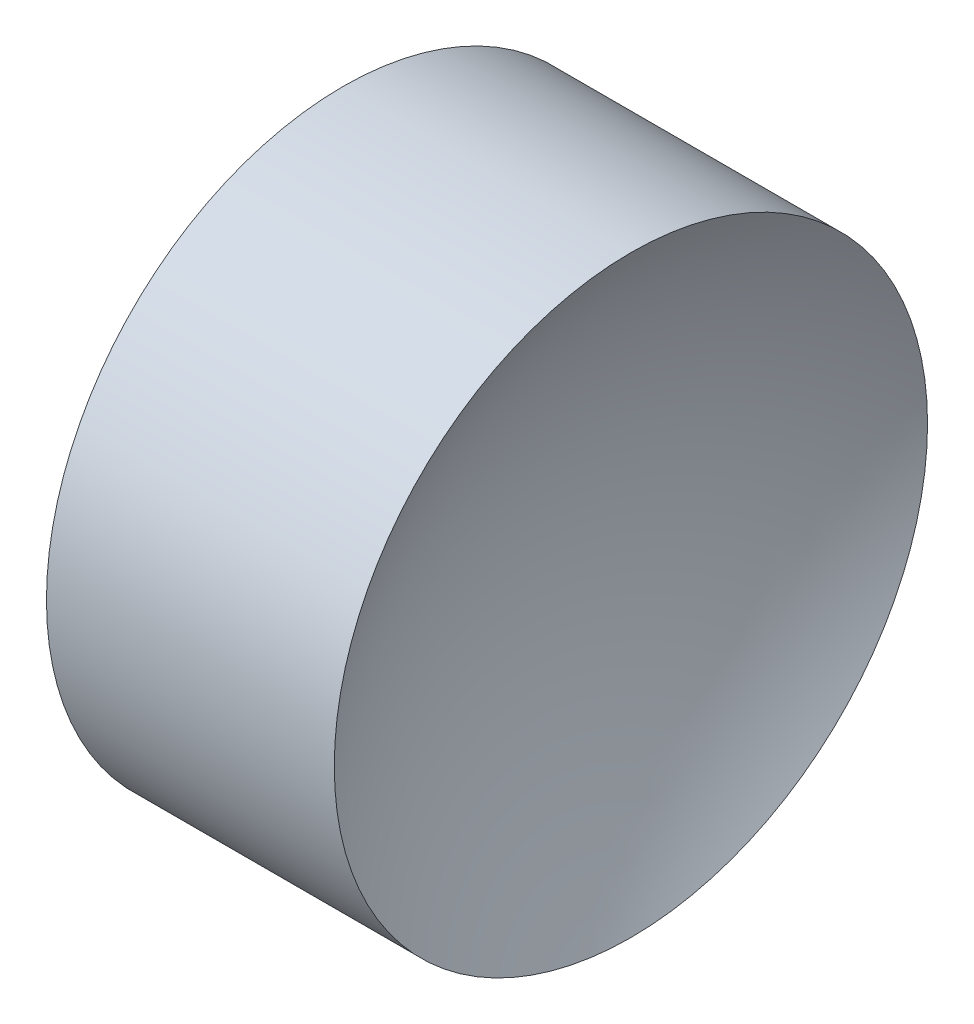
ISO-10303-21;
HEADER;
FILE_DESCRIPTION(('STEP AP214'),'2;1');
FILE_NAME('part.step','',(''),(''),'','','');
FILE_SCHEMA(('AUTOMOTIVE_DESIGN { 1 0 10303 214 1 1 1 1 }'));
ENDSEC;
DATA;
#1=APPLICATION_CONTEXT('core data for automotive mechanical design processes');
#2=APPLICATION_PROTOCOL_DEFINITION('international standard','automotive_design',2000,#1);
#3=PRODUCT_CONTEXT('',#1,'mechanical');
#4=PRODUCT('Part','Part','',(#3));
#5=PRODUCT_RELATED_PRODUCT_CATEGORY('part','',(#4));
#6=PRODUCT_DEFINITION_FORMATION('','',#4);
#7=PRODUCT_DEFINITION_CONTEXT('part definition',#1,'design');
#8=PRODUCT_DEFINITION('design','',#6,#7);
#9=PRODUCT_DEFINITION_SHAPE('','',#8);
#10=(LENGTH_UNIT() NAMED_UNIT(*) SI_UNIT(.MILLI.,.METRE.));
#11=(NAMED_UNIT(*) PLANE_ANGLE_UNIT() SI_UNIT($,.RADIAN.));
#12=(NAMED_UNIT(*) SI_UNIT($,.STERADIAN.) SOLID_ANGLE_UNIT());
#13=UNCERTAINTY_MEASURE_WITH_UNIT(LENGTH_MEASURE(1.E-05),#10,'distance_accuracy_value','');
#14=(GEOMETRIC_REPRESENTATION_CONTEXT(3) GLOBAL_UNCERTAINTY_ASSIGNED_CONTEXT((#13)) GLOBAL_UNIT_ASSIGNED_CONTEXT((#10,
#11,#12)) REPRESENTATION_CONTEXT('',''));
#15=CARTESIAN_POINT('',(0.,0.,0.));
#16=DIRECTION('',(0.,0.,1.));
#17=DIRECTION('',(1.,0.,0.));
#18=AXIS2_PLACEMENT_3D('',#15,#16,#17);
#19=CARTESIAN_POINT('',(13.544256363875,13.0445205745975,0.));
#20=DIRECTION('',(-1.,0.,0.));
#21=DIRECTION('',(0.,1.,0.));
#22=AXIS2_PLACEMENT_3D('',#19,#20,#21);
#23=SPHERICAL_SURFACE('',#22,9.48);
#24=CARTESIAN_POINT('',(21.5984726510131,13.0445205745975,0.));
#25=DIRECTION('',(-1.,0.,0.));
#26=DIRECTION('',(0.,0.,1.));
#27=AXIS2_PLACEMENT_3D('',#24,#25,#26);
#28=CIRCLE('',#27,5.);
#29=CARTESIAN_POINT('',(21.5984726510131,13.0445205745975,5.));
#30=VERTEX_POINT('',#29);
#31=EDGE_CURVE('E41',#30,#30,#28,.T.);
#32=ORIENTED_EDGE('',*,*,#31,.T.);
#33=EDGE_LOOP('',(#32));
#34=FACE_BOUND('',#33,.T.);
#35=ADVANCED_FACE('F35',(#34),#23,.F.);
#36=CARTESIAN_POINT('',(34.504256363875,13.0445205745975,0.));
#37=DIRECTION('',(-1.,0.,0.));
#38=DIRECTION('',(0.,1.,0.));
#39=AXIS2_PLACEMENT_3D('',#36,#37,#38);
#40=SPHERICAL_SURFACE('',#39,9.48);
#41=CARTESIAN_POINT('',(26.450040076737,13.0445205745975,0.));
#42=DIRECTION('',(-1.,0.,0.));
#43=DIRECTION('',(0.,0.,1.));
#44=AXIS2_PLACEMENT_3D('',#41,#42,#43);
#45=CIRCLE('',#44,5.);
#46=CARTESIAN_POINT('',(26.450040076737,13.0445205745975,5.));
#47=VERTEX_POINT('',#46);
#48=EDGE_CURVE('E10',#47,#47,#45,.T.);
#49=ORIENTED_EDGE('',*,*,#48,.F.);
#50=EDGE_LOOP('',(#49));
#51=FACE_BOUND('',#50,.T.);
#52=ADVANCED_FACE('F50',(#51),#40,.F.);
#53=CARTESIAN_POINT('',(21.2249305570684,13.0445205745975,0.));
#54=DIRECTION('',(-1.,0.,0.));
#55=DIRECTION('',(0.,0.,1.));
#56=AXIS2_PLACEMENT_3D('',#53,#54,#55);
#57=CYLINDRICAL_SURFACE('',#56,5.);
#58=ORIENTED_EDGE('',*,*,#31,.F.);
#59=EDGE_LOOP('',(#58));
#60=FACE_BOUND('',#59,.T.);
#61=ORIENTED_EDGE('',*,*,#48,.T.);
#62=EDGE_LOOP('',(#61));
#63=FACE_BOUND('',#62,.T.);
#64=ADVANCED_FACE('F48',(#60,#63),#57,.T.);
#65=CLOSED_SHELL('',(#35,#52,#64));
#66=MANIFOLD_SOLID_BREP('B2',#65);
#67=ADVANCED_BREP_SHAPE_REPRESENTATION('',(#18,#66),#14);
#68=SHAPE_DEFINITION_REPRESENTATION(#9,#67);
ENDSEC;
END-ISO-10303-21;
